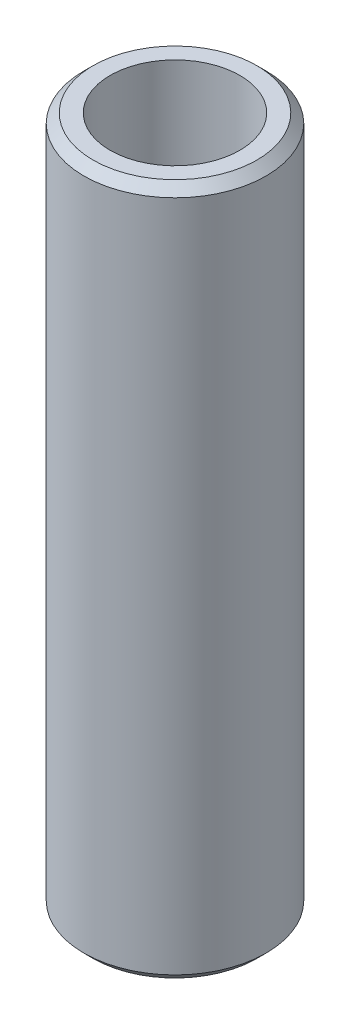
ISO-10303-21;
HEADER;
FILE_DESCRIPTION(('STEP AP214'),'2;1');
FILE_NAME('part.step','',(''),(''),'','','');
FILE_SCHEMA(('AUTOMOTIVE_DESIGN { 1 0 10303 214 1 1 1 1 }'));
ENDSEC;
DATA;
#1=APPLICATION_CONTEXT('core data for automotive mechanical design processes');
#2=APPLICATION_PROTOCOL_DEFINITION('international standard','automotive_design',2000,#1);
#3=PRODUCT_CONTEXT('',#1,'mechanical');
#4=PRODUCT('Part','Part','',(#3));
#5=PRODUCT_RELATED_PRODUCT_CATEGORY('part','',(#4));
#6=PRODUCT_DEFINITION_FORMATION('','',#4);
#7=PRODUCT_DEFINITION_CONTEXT('part definition',#1,'design');
#8=PRODUCT_DEFINITION('design','',#6,#7);
#9=PRODUCT_DEFINITION_SHAPE('','',#8);
#10=(LENGTH_UNIT() NAMED_UNIT(*) SI_UNIT(.MILLI.,.METRE.));
#11=(NAMED_UNIT(*) PLANE_ANGLE_UNIT() SI_UNIT($,.RADIAN.));
#12=(NAMED_UNIT(*) SI_UNIT($,.STERADIAN.) SOLID_ANGLE_UNIT());
#13=UNCERTAINTY_MEASURE_WITH_UNIT(LENGTH_MEASURE(1.E-05),#10,'distance_accuracy_value','');
#14=(GEOMETRIC_REPRESENTATION_CONTEXT(3) GLOBAL_UNCERTAINTY_ASSIGNED_CONTEXT((#13)) GLOBAL_UNIT_ASSIGNED_CONTEXT((#10,
#11,#12)) REPRESENTATION_CONTEXT('',''));
#15=CARTESIAN_POINT('',(0.,0.,0.));
#16=DIRECTION('',(0.,0.,1.));
#17=DIRECTION('',(1.,0.,0.));
#18=AXIS2_PLACEMENT_3D('',#15,#16,#17);
#19=CARTESIAN_POINT('',(0.,360.635368379939,0.));
#20=DIRECTION('',(0.,-1.,0.));
#21=DIRECTION('',(0.,0.,-1.));
#22=AXIS2_PLACEMENT_3D('',#19,#20,#21);
#23=CYLINDRICAL_SURFACE('',#22,47.5);
#24=CARTESIAN_POINT('',(0.,355.846295004965,0.));
#25=DIRECTION('',(0.,1.,0.));
#26=DIRECTION('',(0.,0.,1.));
#27=AXIS2_PLACEMENT_3D('',#24,#25,#26);
#28=CIRCLE('',#27,47.5);
#29=CARTESIAN_POINT('',(0.,355.846295004965,47.5));
#30=VERTEX_POINT('',#29);
#31=EDGE_CURVE('E50',#30,#30,#28,.F.);
#32=ORIENTED_EDGE('',*,*,#31,.T.);
#33=EDGE_LOOP('',(#32));
#34=FACE_BOUND('',#33,.T.);
#35=CARTESIAN_POINT('',(0.,4.78907337497314,0.));
#36=DIRECTION('',(0.,1.,0.));
#37=DIRECTION('',(0.,0.,1.));
#38=AXIS2_PLACEMENT_3D('',#35,#36,#37);
#39=CIRCLE('',#38,47.5);
#40=CARTESIAN_POINT('',(0.,4.78907337497314,47.5));
#41=VERTEX_POINT('',#40);
#42=EDGE_CURVE('E51',#41,#41,#39,.T.);
#43=ORIENTED_EDGE('',*,*,#42,.T.);
#44=EDGE_LOOP('',(#43));
#45=FACE_BOUND('',#44,.T.);
#46=ADVANCED_FACE('F39',(#34,#45),#23,.T.);
#47=CARTESIAN_POINT('',(0.,360.635368379939,0.));
#48=DIRECTION('',(0.,1.,0.));
#49=DIRECTION('',(0.,0.,1.));
#50=AXIS2_PLACEMENT_3D('',#47,#48,#49);
#51=PLANE('',#50);
#52=CARTESIAN_POINT('',(0.,360.635368379939,0.));
#53=DIRECTION('',(0.,1.,0.));
#54=DIRECTION('',(0.,0.,1.));
#55=AXIS2_PLACEMENT_3D('',#52,#53,#54);
#56=CIRCLE('',#55,42.7109266250268);
#57=CARTESIAN_POINT('',(0.,360.635368379939,42.7109266250268));
#58=VERTEX_POINT('',#57);
#59=EDGE_CURVE('E54',#58,#58,#56,.T.);
#60=ORIENTED_EDGE('',*,*,#59,.T.);
#61=EDGE_LOOP('',(#60));
#62=FACE_BOUND('',#61,.T.);
#63=CARTESIAN_POINT('',(0.,360.635368379939,0.));
#64=DIRECTION('',(0.,1.,0.));
#65=DIRECTION('',(0.,0.,1.));
#66=AXIS2_PLACEMENT_3D('',#63,#64,#65);
#67=CIRCLE('',#66,33.8480694297868);
#68=CARTESIAN_POINT('',(0.,360.635368379939,33.8480694297868));
#69=VERTEX_POINT('',#68);
#70=EDGE_CURVE('E58',#69,#69,#67,.T.);
#71=ORIENTED_EDGE('',*,*,#70,.F.);
#72=EDGE_LOOP('',(#71));
#73=FACE_BOUND('',#72,.T.);
#74=ADVANCED_FACE('F69',(#62,#73),#51,.T.);
#75=CARTESIAN_POINT('',(0.,0.,0.));
#76=DIRECTION('',(0.,1.,0.));
#77=DIRECTION('',(0.,0.,1.));
#78=AXIS2_PLACEMENT_3D('',#75,#76,#77);
#79=PLANE('',#78);
#80=CARTESIAN_POINT('',(0.,0.,0.));
#81=DIRECTION('',(0.,1.,0.));
#82=DIRECTION('',(0.,0.,1.));
#83=AXIS2_PLACEMENT_3D('',#80,#81,#82);
#84=CIRCLE('',#83,42.7109266250269);
#85=CARTESIAN_POINT('',(0.,0.,42.7109266250269));
#86=VERTEX_POINT('',#85);
#87=EDGE_CURVE('E10',#86,#86,#84,.F.);
#88=ORIENTED_EDGE('',*,*,#87,.T.);
#89=EDGE_LOOP('',(#88));
#90=FACE_BOUND('',#89,.T.);
#91=CARTESIAN_POINT('',(0.,0.,0.));
#92=DIRECTION('',(0.,1.,0.));
#93=DIRECTION('',(0.,0.,1.));
#94=AXIS2_PLACEMENT_3D('',#91,#92,#93);
#95=CIRCLE('',#94,33.8480694297868);
#96=CARTESIAN_POINT('',(0.,0.,33.8480694297868));
#97=VERTEX_POINT('',#96);
#98=EDGE_CURVE('E63',#97,#97,#95,.T.);
#99=ORIENTED_EDGE('',*,*,#98,.T.);
#100=EDGE_LOOP('',(#99));
#101=FACE_BOUND('',#100,.T.);
#102=ADVANCED_FACE('F75',(#90,#101),#79,.F.);
#103=CARTESIAN_POINT('',(0.,360.635368379939,0.));
#104=DIRECTION('',(0.,-1.,0.));
#105=DIRECTION('',(0.,0.,-1.));
#106=AXIS2_PLACEMENT_3D('',#103,#104,#105);
#107=CYLINDRICAL_SURFACE('',#106,33.8480694297868);
#108=ORIENTED_EDGE('',*,*,#70,.T.);
#109=EDGE_LOOP('',(#108));
#110=FACE_BOUND('',#109,.T.);
#111=ORIENTED_EDGE('',*,*,#98,.F.);
#112=EDGE_LOOP('',(#111));
#113=FACE_BOUND('',#112,.T.);
#114=ADVANCED_FACE('F70',(#110,#113),#107,.F.);
#115=CARTESIAN_POINT('',(0.,360.635368379939,0.));
#116=DIRECTION('',(0.,-1.,0.));
#117=DIRECTION('',(0.,0.,-1.));
#118=AXIS2_PLACEMENT_3D('',#115,#116,#117);
#119=CONICAL_SURFACE('',#118,42.7109266250268,0.785398163397445);
#120=ORIENTED_EDGE('',*,*,#31,.F.);
#121=EDGE_LOOP('',(#120));
#122=FACE_BOUND('',#121,.T.);
#123=ORIENTED_EDGE('',*,*,#59,.F.);
#124=EDGE_LOOP('',(#123));
#125=FACE_BOUND('',#124,.T.);
#126=ADVANCED_FACE('F81',(#122,#125),#119,.T.);
#127=CARTESIAN_POINT('',(0.,4.78907337497314,0.));
#128=DIRECTION('',(0.,1.,0.));
#129=DIRECTION('',(0.,0.,1.));
#130=AXIS2_PLACEMENT_3D('',#127,#128,#129);
#131=CONICAL_SURFACE('',#130,47.5,0.785398163397448);
#132=ORIENTED_EDGE('',*,*,#87,.F.);
#133=EDGE_LOOP('',(#132));
#134=FACE_BOUND('',#133,.T.);
#135=ORIENTED_EDGE('',*,*,#42,.F.);
#136=EDGE_LOOP('',(#135));
#137=FACE_BOUND('',#136,.T.);
#138=ADVANCED_FACE('F45',(#134,#137),#131,.T.);
#139=CLOSED_SHELL('',(#46,#74,#102,#114,#126,#138));
#140=MANIFOLD_SOLID_BREP('B2',#139);
#141=ADVANCED_BREP_SHAPE_REPRESENTATION('',(#18,#140),#14);
#142=SHAPE_DEFINITION_REPRESENTATION(#9,#141);
ENDSEC;
END-ISO-10303-21;
